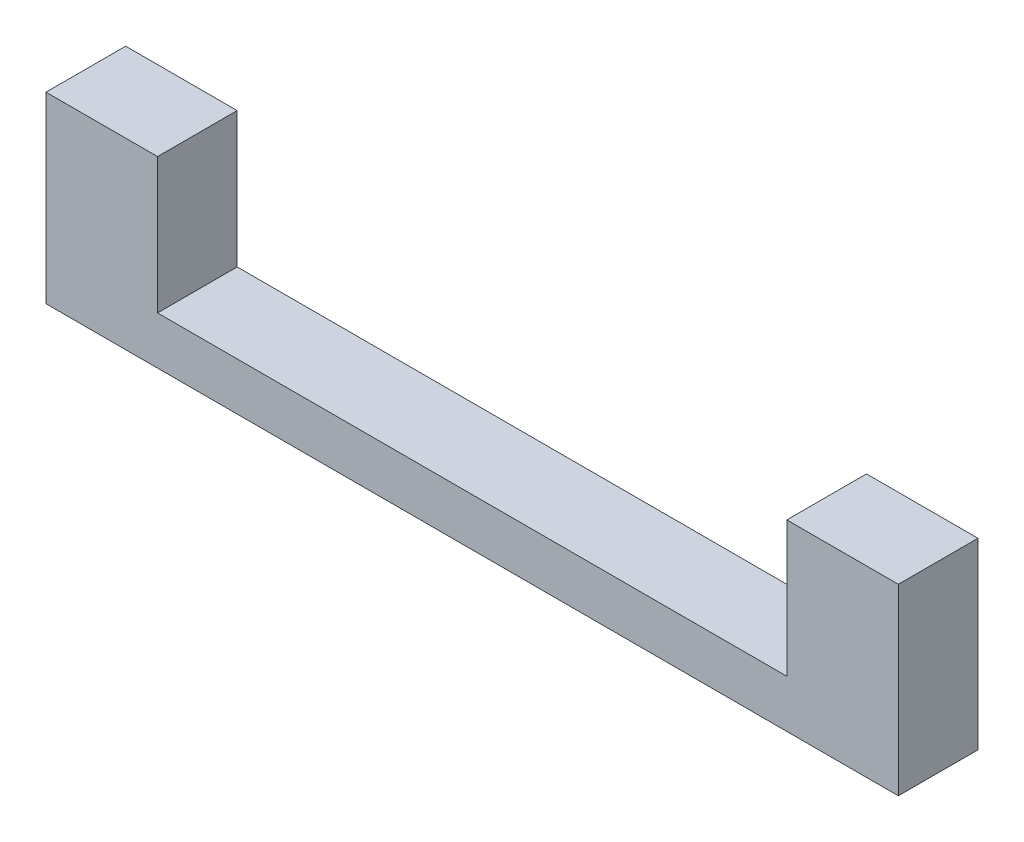
ISO-10303-21;
HEADER;
FILE_DESCRIPTION(('STEP AP214'),'2;1');
FILE_NAME('part.step','',(''),(''),'','','');
FILE_SCHEMA(('AUTOMOTIVE_DESIGN { 1 0 10303 214 1 1 1 1 }'));
ENDSEC;
DATA;
#1=APPLICATION_CONTEXT('core data for automotive mechanical design processes');
#2=APPLICATION_PROTOCOL_DEFINITION('international standard','automotive_design',2000,#1);
#3=PRODUCT_CONTEXT('',#1,'mechanical');
#4=PRODUCT('Part','Part','',(#3));
#5=PRODUCT_RELATED_PRODUCT_CATEGORY('part','',(#4));
#6=PRODUCT_DEFINITION_FORMATION('','',#4);
#7=PRODUCT_DEFINITION_CONTEXT('part definition',#1,'design');
#8=PRODUCT_DEFINITION('design','',#6,#7);
#9=PRODUCT_DEFINITION_SHAPE('','',#8);
#10=(LENGTH_UNIT() NAMED_UNIT(*) SI_UNIT(.MILLI.,.METRE.));
#11=(NAMED_UNIT(*) PLANE_ANGLE_UNIT() SI_UNIT($,.RADIAN.));
#12=(NAMED_UNIT(*) SI_UNIT($,.STERADIAN.) SOLID_ANGLE_UNIT());
#13=UNCERTAINTY_MEASURE_WITH_UNIT(LENGTH_MEASURE(1.E-05),#10,'distance_accuracy_value','');
#14=(GEOMETRIC_REPRESENTATION_CONTEXT(3) GLOBAL_UNCERTAINTY_ASSIGNED_CONTEXT((#13)) GLOBAL_UNIT_ASSIGNED_CONTEXT((#10,
#11,#12)) REPRESENTATION_CONTEXT('',''));
#15=CARTESIAN_POINT('',(0.,0.,0.));
#16=DIRECTION('',(0.,0.,1.));
#17=DIRECTION('',(1.,0.,0.));
#18=AXIS2_PLACEMENT_3D('',#15,#16,#17);
#19=CARTESIAN_POINT('',(5.,4.25,4.25));
#20=DIRECTION('',(0.,-1.,0.));
#21=DIRECTION('',(0.,0.,-1.));
#22=AXIS2_PLACEMENT_3D('',#19,#20,#21);
#23=PLANE('',#22);
#24=DIRECTION('',(0.,0.,1.));
#25=VECTOR('',#24,1.);
#26=CARTESIAN_POINT('',(5.,4.25,4.25));
#27=LINE('',#26,#25);
#28=CARTESIAN_POINT('',(5.,4.25,-0.750000000000002));
#29=VERTEX_POINT('',#28);
#30=CARTESIAN_POINT('',(5.,4.25,4.25));
#31=VERTEX_POINT('',#30);
#32=EDGE_CURVE('E120',#29,#31,#27,.T.);
#33=ORIENTED_EDGE('',*,*,#32,.F.);
#34=DIRECTION('',(1.,0.,0.));
#35=VECTOR('',#34,1.);
#36=CARTESIAN_POINT('',(-2.,4.25,-0.750000000000002));
#37=LINE('',#36,#35);
#38=CARTESIAN_POINT('',(-2.,4.25,-0.750000000000002));
#39=VERTEX_POINT('',#38);
#40=EDGE_CURVE('E57',#39,#29,#37,.T.);
#41=ORIENTED_EDGE('',*,*,#40,.F.);
#42=DIRECTION('',(0.,0.,-1.));
#43=VECTOR('',#42,1.);
#44=CARTESIAN_POINT('',(-2.,4.25,-4.25));
#45=LINE('',#44,#43);
#46=CARTESIAN_POINT('',(-2.,4.25,4.25));
#47=VERTEX_POINT('',#46);
#48=EDGE_CURVE('E119',#47,#39,#45,.T.);
#49=ORIENTED_EDGE('',*,*,#48,.F.);
#50=DIRECTION('',(-1.,0.,0.));
#51=VECTOR('',#50,1.);
#52=CARTESIAN_POINT('',(5.,4.25,4.25));
#53=LINE('',#52,#51);
#54=EDGE_CURVE('E51',#31,#47,#53,.T.);
#55=ORIENTED_EDGE('',*,*,#54,.F.);
#56=EDGE_LOOP('',(#33,#41,#49,#55));
#57=FACE_BOUND('',#56,.T.);
#58=ADVANCED_FACE('F43',(#57),#23,.F.);
#59=CARTESIAN_POINT('',(0.,-4.25,0.));
#60=DIRECTION('',(0.,-1.,0.));
#61=DIRECTION('',(0.,0.,-1.));
#62=AXIS2_PLACEMENT_3D('',#59,#60,#61);
#63=PLANE('',#62);
#64=DIRECTION('',(0.,0.,1.));
#65=VECTOR('',#64,1.);
#66=CARTESIAN_POINT('',(44.5,-4.25,-4.25));
#67=LINE('',#66,#65);
#68=CARTESIAN_POINT('',(44.5,-4.25,-0.750000000000002));
#69=VERTEX_POINT('',#68);
#70=CARTESIAN_POINT('',(44.5,-4.25,4.25));
#71=VERTEX_POINT('',#70);
#72=EDGE_CURVE('E158',#69,#71,#67,.T.);
#73=ORIENTED_EDGE('',*,*,#72,.F.);
#74=DIRECTION('',(-1.,0.,0.));
#75=VECTOR('',#74,1.);
#76=CARTESIAN_POINT('',(0.,-4.25,-0.750000000000002));
#77=LINE('',#76,#75);
#78=CARTESIAN_POINT('',(5.,-4.25,-0.750000000000002));
#79=VERTEX_POINT('',#78);
#80=EDGE_CURVE('E183',#69,#79,#77,.T.);
#81=ORIENTED_EDGE('',*,*,#80,.T.);
#82=DIRECTION('',(0.,0.,-1.));
#83=VECTOR('',#82,1.);
#84=CARTESIAN_POINT('',(5.,-4.25,4.25));
#85=LINE('',#84,#83);
#86=CARTESIAN_POINT('',(5.,-4.25,4.25));
#87=VERTEX_POINT('',#86);
#88=EDGE_CURVE('E169',#87,#79,#85,.T.);
#89=ORIENTED_EDGE('',*,*,#88,.F.);
#90=DIRECTION('',(-1.,0.,0.));
#91=VECTOR('',#90,1.);
#92=CARTESIAN_POINT('',(-2.,-4.25,4.25));
#93=LINE('',#92,#91);
#94=EDGE_CURVE('E136',#71,#87,#93,.T.);
#95=ORIENTED_EDGE('',*,*,#94,.F.);
#96=EDGE_LOOP('',(#73,#81,#89,#95));
#97=FACE_BOUND('',#96,.T.);
#98=ADVANCED_FACE('F217',(#97),#63,.F.);
#99=CARTESIAN_POINT('',(5.,-4.25,4.25));
#100=DIRECTION('',(0.,0.,-1.));
#101=DIRECTION('',(-1.,0.,0.));
#102=AXIS2_PLACEMENT_3D('',#99,#100,#101);
#103=PLANE('',#102);
#104=DIRECTION('',(0.,1.,0.));
#105=VECTOR('',#104,1.);
#106=CARTESIAN_POINT('',(51.5,-7.25,4.25));
#107=LINE('',#106,#105);
#108=CARTESIAN_POINT('',(51.5,-7.25,4.25));
#109=VERTEX_POINT('',#108);
#110=CARTESIAN_POINT('',(51.5,4.25,4.25));
#111=VERTEX_POINT('',#110);
#112=EDGE_CURVE('E130',#109,#111,#107,.T.);
#113=ORIENTED_EDGE('',*,*,#112,.T.);
#114=DIRECTION('',(-1.,0.,0.));
#115=VECTOR('',#114,1.);
#116=CARTESIAN_POINT('',(51.5,4.25,4.25));
#117=LINE('',#116,#115);
#118=CARTESIAN_POINT('',(44.5,4.25,4.25));
#119=VERTEX_POINT('',#118);
#120=EDGE_CURVE('E149',#111,#119,#117,.T.);
#121=ORIENTED_EDGE('',*,*,#120,.T.);
#122=DIRECTION('',(0.,-1.,0.));
#123=VECTOR('',#122,1.);
#124=CARTESIAN_POINT('',(44.5,15.2613577727726,4.25));
#125=LINE('',#124,#123);
#126=EDGE_CURVE('E154',#119,#71,#125,.T.);
#127=ORIENTED_EDGE('',*,*,#126,.T.);
#128=ORIENTED_EDGE('',*,*,#94,.T.);
#129=DIRECTION('',(0.,-1.,0.));
#130=VECTOR('',#129,1.);
#131=CARTESIAN_POINT('',(5.,4.25,4.25));
#132=LINE('',#131,#130);
#133=EDGE_CURVE('E173',#31,#87,#132,.T.);
#134=ORIENTED_EDGE('',*,*,#133,.F.);
#135=ORIENTED_EDGE('',*,*,#54,.T.);
#136=DIRECTION('',(0.,1.,0.));
#137=VECTOR('',#136,1.);
#138=CARTESIAN_POINT('',(-2.,-4.25,4.25));
#139=LINE('',#138,#137);
#140=CARTESIAN_POINT('',(-2.,-7.25,4.25));
#141=VERTEX_POINT('',#140);
#142=EDGE_CURVE('E125',#141,#47,#139,.T.);
#143=ORIENTED_EDGE('',*,*,#142,.F.);
#144=DIRECTION('',(-1.,0.,0.));
#145=VECTOR('',#144,1.);
#146=CARTESIAN_POINT('',(-2.,-7.25,4.25));
#147=LINE('',#146,#145);
#148=EDGE_CURVE('E135',#109,#141,#147,.T.);
#149=ORIENTED_EDGE('',*,*,#148,.F.);
#150=EDGE_LOOP('',(#113,#121,#127,#128,#134,#135,#143,#149));
#151=FACE_BOUND('',#150,.T.);
#152=ADVANCED_FACE('F200',(#151),#103,.F.);
#153=CARTESIAN_POINT('',(-2.,0.,0.));
#154=DIRECTION('',(1.,0.,0.));
#155=DIRECTION('',(0.,0.,-1.));
#156=AXIS2_PLACEMENT_3D('',#153,#154,#155);
#157=PLANE('',#156);
#158=ORIENTED_EDGE('',*,*,#48,.T.);
#159=DIRECTION('',(0.,1.,0.));
#160=VECTOR('',#159,1.);
#161=CARTESIAN_POINT('',(-2.,-10.75,-0.750000000000002));
#162=LINE('',#161,#160);
#163=CARTESIAN_POINT('',(-2.,-7.25,-0.750000000000002));
#164=VERTEX_POINT('',#163);
#165=EDGE_CURVE('E105',#164,#39,#162,.T.);
#166=ORIENTED_EDGE('',*,*,#165,.F.);
#167=DIRECTION('',(0.,0.,-1.));
#168=VECTOR('',#167,1.);
#169=CARTESIAN_POINT('',(-2.,-7.25,4.25));
#170=LINE('',#169,#168);
#171=EDGE_CURVE('E139',#141,#164,#170,.T.);
#172=ORIENTED_EDGE('',*,*,#171,.F.);
#173=ORIENTED_EDGE('',*,*,#142,.T.);
#174=EDGE_LOOP('',(#158,#166,#172,#173));
#175=FACE_BOUND('',#174,.T.);
#176=ADVANCED_FACE('F124',(#175),#157,.F.);
#177=CARTESIAN_POINT('',(51.5,-7.25,4.25));
#178=DIRECTION('',(-1.,0.,0.));
#179=DIRECTION('',(0.,0.,1.));
#180=AXIS2_PLACEMENT_3D('',#177,#178,#179);
#181=PLANE('',#180);
#182=DIRECTION('',(0.,1.,0.));
#183=VECTOR('',#182,1.);
#184=CARTESIAN_POINT('',(51.5,-10.75,-0.750000000000002));
#185=LINE('',#184,#183);
#186=CARTESIAN_POINT('',(51.5,-7.25,-0.750000000000002));
#187=VERTEX_POINT('',#186);
#188=CARTESIAN_POINT('',(51.5,4.25,-0.750000000000002));
#189=VERTEX_POINT('',#188);
#190=EDGE_CURVE('E114',#187,#189,#185,.T.);
#191=ORIENTED_EDGE('',*,*,#190,.T.);
#192=DIRECTION('',(0.,0.,1.));
#193=VECTOR('',#192,1.);
#194=CARTESIAN_POINT('',(51.5,4.25,-4.25));
#195=LINE('',#194,#193);
#196=EDGE_CURVE('E140',#189,#111,#195,.T.);
#197=ORIENTED_EDGE('',*,*,#196,.T.);
#198=ORIENTED_EDGE('',*,*,#112,.F.);
#199=DIRECTION('',(0.,0.,1.));
#200=VECTOR('',#199,1.);
#201=CARTESIAN_POINT('',(51.5,-7.25,4.25));
#202=LINE('',#201,#200);
#203=EDGE_CURVE('E144',#187,#109,#202,.T.);
#204=ORIENTED_EDGE('',*,*,#203,.F.);
#205=EDGE_LOOP('',(#191,#197,#198,#204));
#206=FACE_BOUND('',#205,.T.);
#207=ADVANCED_FACE('F191',(#206),#181,.F.);
#208=CARTESIAN_POINT('',(0.,-7.25,0.));
#209=DIRECTION('',(0.,-1.,0.));
#210=DIRECTION('',(0.,0.,-1.));
#211=AXIS2_PLACEMENT_3D('',#208,#209,#210);
#212=PLANE('',#211);
#213=DIRECTION('',(-1.,0.,0.));
#214=VECTOR('',#213,1.);
#215=CARTESIAN_POINT('',(0.,-7.25,-0.750000000000002));
#216=LINE('',#215,#214);
#217=EDGE_CURVE('E108',#187,#164,#216,.T.);
#218=ORIENTED_EDGE('',*,*,#217,.F.);
#219=ORIENTED_EDGE('',*,*,#203,.T.);
#220=ORIENTED_EDGE('',*,*,#148,.T.);
#221=ORIENTED_EDGE('',*,*,#171,.T.);
#222=EDGE_LOOP('',(#218,#219,#220,#221));
#223=FACE_BOUND('',#222,.T.);
#224=ADVANCED_FACE('F204',(#223),#212,.T.);
#225=CARTESIAN_POINT('',(44.5,15.2613577727726,-4.25));
#226=DIRECTION('',(1.,0.,0.));
#227=DIRECTION('',(0.,0.,-1.));
#228=AXIS2_PLACEMENT_3D('',#225,#226,#227);
#229=PLANE('',#228);
#230=DIRECTION('',(0.,0.,-1.));
#231=VECTOR('',#230,1.);
#232=CARTESIAN_POINT('',(44.5,4.25,-4.25));
#233=LINE('',#232,#231);
#234=CARTESIAN_POINT('',(44.5,4.25,-0.750000000000002));
#235=VERTEX_POINT('',#234);
#236=EDGE_CURVE('E153',#119,#235,#233,.T.);
#237=ORIENTED_EDGE('',*,*,#236,.T.);
#238=DIRECTION('',(0.,-1.,0.));
#239=VECTOR('',#238,1.);
#240=CARTESIAN_POINT('',(44.5,15.2613577727726,-0.750000000000002));
#241=LINE('',#240,#239);
#242=EDGE_CURVE('E179',#235,#69,#241,.T.);
#243=ORIENTED_EDGE('',*,*,#242,.T.);
#244=ORIENTED_EDGE('',*,*,#72,.T.);
#245=ORIENTED_EDGE('',*,*,#126,.F.);
#246=EDGE_LOOP('',(#237,#243,#244,#245));
#247=FACE_BOUND('',#246,.T.);
#248=ADVANCED_FACE('F206',(#247),#229,.F.);
#249=CARTESIAN_POINT('',(5.,4.25,4.25));
#250=DIRECTION('',(0.,-1.,0.));
#251=DIRECTION('',(0.,0.,-1.));
#252=AXIS2_PLACEMENT_3D('',#249,#250,#251);
#253=PLANE('',#252);
#254=ORIENTED_EDGE('',*,*,#196,.F.);
#255=EDGE_CURVE('E122',#235,#189,#37,.T.);
#256=ORIENTED_EDGE('',*,*,#255,.F.);
#257=ORIENTED_EDGE('',*,*,#236,.F.);
#258=ORIENTED_EDGE('',*,*,#120,.F.);
#259=EDGE_LOOP('',(#254,#256,#257,#258));
#260=FACE_BOUND('',#259,.T.);
#261=ADVANCED_FACE('F198',(#260),#253,.F.);
#262=CARTESIAN_POINT('',(5.,0.,0.));
#263=DIRECTION('',(1.,0.,0.));
#264=DIRECTION('',(0.,0.,-1.));
#265=AXIS2_PLACEMENT_3D('',#262,#263,#264);
#266=PLANE('',#265);
#267=DIRECTION('',(0.,-1.,0.));
#268=VECTOR('',#267,1.);
#269=CARTESIAN_POINT('',(5.,0.,-0.750000000000002));
#270=LINE('',#269,#268);
#271=EDGE_CURVE('E11',#29,#79,#270,.T.);
#272=ORIENTED_EDGE('',*,*,#271,.F.);
#273=ORIENTED_EDGE('',*,*,#32,.T.);
#274=ORIENTED_EDGE('',*,*,#133,.T.);
#275=ORIENTED_EDGE('',*,*,#88,.T.);
#276=EDGE_LOOP('',(#272,#273,#274,#275));
#277=FACE_BOUND('',#276,.T.);
#278=ADVANCED_FACE('F250',(#277),#266,.T.);
#279=CARTESIAN_POINT('',(-2.,-10.75,-0.750000000000002));
#280=DIRECTION('',(0.,0.,1.));
#281=DIRECTION('',(1.,0.,0.));
#282=AXIS2_PLACEMENT_3D('',#279,#280,#281);
#283=PLANE('',#282);
#284=ORIENTED_EDGE('',*,*,#80,.F.);
#285=ORIENTED_EDGE('',*,*,#242,.F.);
#286=ORIENTED_EDGE('',*,*,#255,.T.);
#287=ORIENTED_EDGE('',*,*,#190,.F.);
#288=ORIENTED_EDGE('',*,*,#217,.T.);
#289=ORIENTED_EDGE('',*,*,#165,.T.);
#290=ORIENTED_EDGE('',*,*,#40,.T.);
#291=ORIENTED_EDGE('',*,*,#271,.T.);
#292=EDGE_LOOP('',(#284,#285,#286,#287,#288,#289,#290,#291));
#293=FACE_BOUND('',#292,.T.);
#294=ADVANCED_FACE('F106',(#293),#283,.F.);
#295=CLOSED_SHELL('',(#58,#98,#152,#176,#207,#224,#248,#261,#278,#294));
#296=MANIFOLD_SOLID_BREP('B2',#295);
#297=ADVANCED_BREP_SHAPE_REPRESENTATION('',(#18,#296),#14);
#298=SHAPE_DEFINITION_REPRESENTATION(#9,#297);
ENDSEC;
END-ISO-10303-21;
